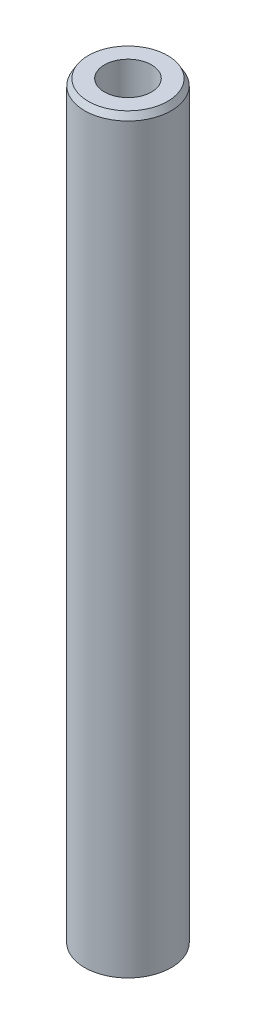
ISO-10303-21;
HEADER;
FILE_DESCRIPTION(('STEP AP214'),'2;1');
FILE_NAME('part.step','',(''),(''),'','','');
FILE_SCHEMA(('AUTOMOTIVE_DESIGN { 1 0 10303 214 1 1 1 1 }'));
ENDSEC;
DATA;
#1=APPLICATION_CONTEXT('core data for automotive mechanical design processes');
#2=APPLICATION_PROTOCOL_DEFINITION('international standard','automotive_design',2000,#1);
#3=PRODUCT_CONTEXT('',#1,'mechanical');
#4=PRODUCT('Part','Part','',(#3));
#5=PRODUCT_RELATED_PRODUCT_CATEGORY('part','',(#4));
#6=PRODUCT_DEFINITION_FORMATION('','',#4);
#7=PRODUCT_DEFINITION_CONTEXT('part definition',#1,'design');
#8=PRODUCT_DEFINITION('design','',#6,#7);
#9=PRODUCT_DEFINITION_SHAPE('','',#8);
#10=(LENGTH_UNIT() NAMED_UNIT(*) SI_UNIT(.MILLI.,.METRE.));
#11=(NAMED_UNIT(*) PLANE_ANGLE_UNIT() SI_UNIT($,.RADIAN.));
#12=(NAMED_UNIT(*) SI_UNIT($,.STERADIAN.) SOLID_ANGLE_UNIT());
#13=UNCERTAINTY_MEASURE_WITH_UNIT(LENGTH_MEASURE(1.E-05),#10,'distance_accuracy_value','');
#14=(GEOMETRIC_REPRESENTATION_CONTEXT(3) GLOBAL_UNCERTAINTY_ASSIGNED_CONTEXT((#13)) GLOBAL_UNIT_ASSIGNED_CONTEXT((#10,
#11,#12)) REPRESENTATION_CONTEXT('',''));
#15=CARTESIAN_POINT('',(0.,0.,0.));
#16=DIRECTION('',(0.,0.,1.));
#17=DIRECTION('',(1.,0.,0.));
#18=AXIS2_PLACEMENT_3D('',#15,#16,#17);
#19=CARTESIAN_POINT('',(0.,260.302804772644,0.));
#20=DIRECTION('',(0.,-1.,0.));
#21=DIRECTION('',(0.,0.,-1.));
#22=AXIS2_PLACEMENT_3D('',#19,#20,#21);
#23=CYLINDRICAL_SURFACE('',#22,15.);
#24=CARTESIAN_POINT('',(0.,258.122272246579,0.));
#25=DIRECTION('',(0.,1.,0.));
#26=DIRECTION('',(0.,0.,1.));
#27=AXIS2_PLACEMENT_3D('',#24,#25,#26);
#28=CIRCLE('',#27,15.);
#29=CARTESIAN_POINT('',(0.,258.122272246579,15.));
#30=VERTEX_POINT('',#29);
#31=EDGE_CURVE('E50',#30,#30,#28,.F.);
#32=ORIENTED_EDGE('',*,*,#31,.T.);
#33=EDGE_LOOP('',(#32));
#34=FACE_BOUND('',#33,.T.);
#35=CARTESIAN_POINT('',(0.,1.25893104090052,0.));
#36=DIRECTION('',(0.,1.,0.));
#37=DIRECTION('',(0.,0.,1.));
#38=AXIS2_PLACEMENT_3D('',#35,#36,#37);
#39=CIRCLE('',#38,15.);
#40=CARTESIAN_POINT('',(0.,1.25893104090052,15.));
#41=VERTEX_POINT('',#40);
#42=EDGE_CURVE('E51',#41,#41,#39,.T.);
#43=ORIENTED_EDGE('',*,*,#42,.T.);
#44=EDGE_LOOP('',(#43));
#45=FACE_BOUND('',#44,.T.);
#46=ADVANCED_FACE('F39',(#34,#45),#23,.T.);
#47=CARTESIAN_POINT('',(0.,260.302804772644,0.));
#48=DIRECTION('',(0.,1.,0.));
#49=DIRECTION('',(0.,0.,1.));
#50=AXIS2_PLACEMENT_3D('',#47,#48,#49);
#51=PLANE('',#50);
#52=CARTESIAN_POINT('',(0.,260.302804772644,0.));
#53=DIRECTION('',(0.,1.,0.));
#54=DIRECTION('',(0.,0.,1.));
#55=AXIS2_PLACEMENT_3D('',#52,#53,#54);
#56=CIRCLE('',#55,13.7410689590995);
#57=CARTESIAN_POINT('',(0.,260.302804772644,13.7410689590995));
#58=VERTEX_POINT('',#57);
#59=EDGE_CURVE('E54',#58,#58,#56,.T.);
#60=ORIENTED_EDGE('',*,*,#59,.T.);
#61=EDGE_LOOP('',(#60));
#62=FACE_BOUND('',#61,.T.);
#63=CARTESIAN_POINT('',(0.,260.302804772644,0.));
#64=DIRECTION('',(0.,1.,0.));
#65=DIRECTION('',(0.,0.,1.));
#66=AXIS2_PLACEMENT_3D('',#63,#64,#65);
#67=CIRCLE('',#66,8.15560425580308);
#68=CARTESIAN_POINT('',(0.,260.302804772644,8.15560425580308));
#69=VERTEX_POINT('',#68);
#70=EDGE_CURVE('E58',#69,#69,#67,.T.);
#71=ORIENTED_EDGE('',*,*,#70,.F.);
#72=EDGE_LOOP('',(#71));
#73=FACE_BOUND('',#72,.T.);
#74=ADVANCED_FACE('F69',(#62,#73),#51,.T.);
#75=CARTESIAN_POINT('',(0.,0.,0.));
#76=DIRECTION('',(0.,1.,0.));
#77=DIRECTION('',(0.,0.,1.));
#78=AXIS2_PLACEMENT_3D('',#75,#76,#77);
#79=PLANE('',#78);
#80=CARTESIAN_POINT('',(0.,0.,0.));
#81=DIRECTION('',(0.,1.,0.));
#82=DIRECTION('',(0.,0.,1.));
#83=AXIS2_PLACEMENT_3D('',#80,#81,#82);
#84=CIRCLE('',#83,12.8194674739347);
#85=CARTESIAN_POINT('',(0.,0.,12.8194674739347));
#86=VERTEX_POINT('',#85);
#87=EDGE_CURVE('E10',#86,#86,#84,.F.);
#88=ORIENTED_EDGE('',*,*,#87,.T.);
#89=EDGE_LOOP('',(#88));
#90=FACE_BOUND('',#89,.T.);
#91=CARTESIAN_POINT('',(0.,0.,0.));
#92=DIRECTION('',(0.,1.,0.));
#93=DIRECTION('',(0.,0.,1.));
#94=AXIS2_PLACEMENT_3D('',#91,#92,#93);
#95=CIRCLE('',#94,8.15560425580308);
#96=CARTESIAN_POINT('',(0.,0.,8.15560425580308));
#97=VERTEX_POINT('',#96);
#98=EDGE_CURVE('E63',#97,#97,#95,.T.);
#99=ORIENTED_EDGE('',*,*,#98,.T.);
#100=EDGE_LOOP('',(#99));
#101=FACE_BOUND('',#100,.T.);
#102=ADVANCED_FACE('F75',(#90,#101),#79,.F.);
#103=CARTESIAN_POINT('',(0.,260.302804772644,0.));
#104=DIRECTION('',(0.,-1.,0.));
#105=DIRECTION('',(0.,0.,-1.));
#106=AXIS2_PLACEMENT_3D('',#103,#104,#105);
#107=CYLINDRICAL_SURFACE('',#106,8.15560425580308);
#108=ORIENTED_EDGE('',*,*,#70,.T.);
#109=EDGE_LOOP('',(#108));
#110=FACE_BOUND('',#109,.T.);
#111=ORIENTED_EDGE('',*,*,#98,.F.);
#112=EDGE_LOOP('',(#111));
#113=FACE_BOUND('',#112,.T.);
#114=ADVANCED_FACE('F70',(#110,#113),#107,.F.);
#115=CARTESIAN_POINT('',(0.,260.302804772644,0.));
#116=DIRECTION('',(0.,-1.,0.));
#117=DIRECTION('',(0.,0.,-1.));
#118=AXIS2_PLACEMENT_3D('',#115,#116,#117);
#119=CONICAL_SURFACE('',#118,13.7410689590995,0.523598775598298);
#120=ORIENTED_EDGE('',*,*,#31,.F.);
#121=EDGE_LOOP('',(#120));
#122=FACE_BOUND('',#121,.T.);
#123=ORIENTED_EDGE('',*,*,#59,.F.);
#124=EDGE_LOOP('',(#123));
#125=FACE_BOUND('',#124,.T.);
#126=ADVANCED_FACE('F81',(#122,#125),#119,.T.);
#127=CARTESIAN_POINT('',(0.,1.25893104090052,0.));
#128=DIRECTION('',(0.,1.,0.));
#129=DIRECTION('',(0.,0.,1.));
#130=AXIS2_PLACEMENT_3D('',#127,#128,#129);
#131=CONICAL_SURFACE('',#130,15.,1.0471975511966);
#132=ORIENTED_EDGE('',*,*,#87,.F.);
#133=EDGE_LOOP('',(#132));
#134=FACE_BOUND('',#133,.T.);
#135=ORIENTED_EDGE('',*,*,#42,.F.);
#136=EDGE_LOOP('',(#135));
#137=FACE_BOUND('',#136,.T.);
#138=ADVANCED_FACE('F45',(#134,#137),#131,.T.);
#139=CLOSED_SHELL('',(#46,#74,#102,#114,#126,#138));
#140=MANIFOLD_SOLID_BREP('B2',#139);
#141=ADVANCED_BREP_SHAPE_REPRESENTATION('',(#18,#140),#14);
#142=SHAPE_DEFINITION_REPRESENTATION(#9,#141);
ENDSEC;
END-ISO-10303-21;
